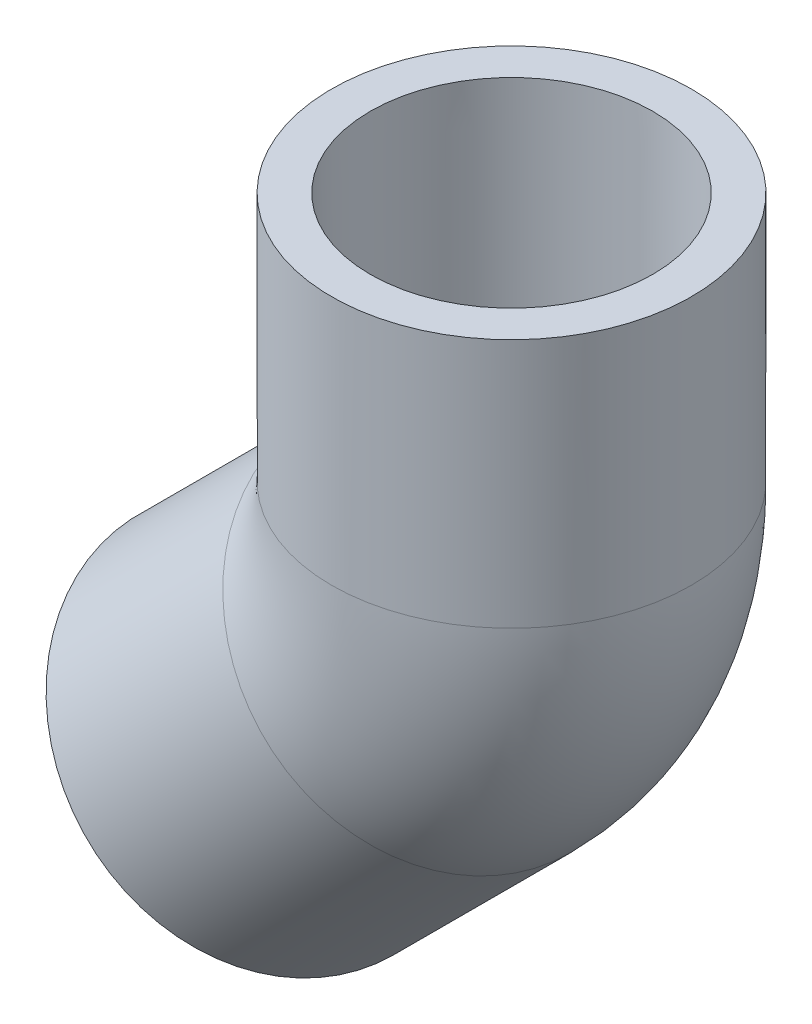
ISO-10303-21;
HEADER;
FILE_DESCRIPTION(('STEP AP214'),'2;1');
FILE_NAME('part.step','',(''),(''),'','','');
FILE_SCHEMA(('AUTOMOTIVE_DESIGN { 1 0 10303 214 1 1 1 1 }'));
ENDSEC;
DATA;
#1=APPLICATION_CONTEXT('core data for automotive mechanical design processes');
#2=APPLICATION_PROTOCOL_DEFINITION('international standard','automotive_design',2000,#1);
#3=PRODUCT_CONTEXT('',#1,'mechanical');
#4=PRODUCT('Part','Part','',(#3));
#5=PRODUCT_RELATED_PRODUCT_CATEGORY('part','',(#4));
#6=PRODUCT_DEFINITION_FORMATION('','',#4);
#7=PRODUCT_DEFINITION_CONTEXT('part definition',#1,'design');
#8=PRODUCT_DEFINITION('design','',#6,#7);
#9=PRODUCT_DEFINITION_SHAPE('','',#8);
#10=(LENGTH_UNIT() NAMED_UNIT(*) SI_UNIT(.MILLI.,.METRE.));
#11=(NAMED_UNIT(*) PLANE_ANGLE_UNIT() SI_UNIT($,.RADIAN.));
#12=(NAMED_UNIT(*) SI_UNIT($,.STERADIAN.) SOLID_ANGLE_UNIT());
#13=UNCERTAINTY_MEASURE_WITH_UNIT(LENGTH_MEASURE(1.E-05),#10,'distance_accuracy_value','');
#14=(GEOMETRIC_REPRESENTATION_CONTEXT(3) GLOBAL_UNCERTAINTY_ASSIGNED_CONTEXT((#13)) GLOBAL_UNIT_ASSIGNED_CONTEXT((#10,
#11,#12)) REPRESENTATION_CONTEXT('',''));
#15=CARTESIAN_POINT('',(0.,0.,0.));
#16=DIRECTION('',(0.,0.,1.));
#17=DIRECTION('',(1.,0.,0.));
#18=AXIS2_PLACEMENT_3D('',#15,#16,#17);
#19=CARTESIAN_POINT('',(-8.9802561210692,-28.3776093425785,0.));
#20=DIRECTION('',(-0.707106781186549,-0.707106781186546,0.));
#21=DIRECTION('',(0.707106781186546,-0.707106781186549,0.));
#22=AXIS2_PLACEMENT_3D('',#19,#20,#21);
#23=PLANE('',#22);
#24=CARTESIAN_POINT('',(-18.6789327318239,-18.6789327318238,0.));
#25=DIRECTION('',(-0.707106781186549,-0.707106781186546,0.));
#26=DIRECTION('',(0.707106781186546,-0.707106781186549,0.));
#27=AXIS2_PLACEMENT_3D('',#24,#25,#26);
#28=CIRCLE('',#27,13.716);
#29=CARTESIAN_POINT('',(-8.9802561210692,-28.3776093425785,0.));
#30=VERTEX_POINT('',#29);
#31=EDGE_CURVE('E48',#30,#30,#28,.T.);
#32=ORIENTED_EDGE('',*,*,#31,.T.);
#33=EDGE_LOOP('',(#32));
#34=FACE_BOUND('',#33,.T.);
#35=CARTESIAN_POINT('',(-18.6789327318239,-18.6789327318238,0.));
#36=DIRECTION('',(-0.707106781186549,-0.707106781186546,0.));
#37=DIRECTION('',(0.707106781186546,-0.707106781186549,0.));
#38=AXIS2_PLACEMENT_3D('',#35,#36,#37);
#39=CIRCLE('',#38,10.7696);
#40=CARTESIAN_POINT('',(-11.0636755411572,-26.2941899224905,0.));
#41=VERTEX_POINT('',#40);
#42=EDGE_CURVE('E35',#41,#41,#39,.T.);
#43=ORIENTED_EDGE('',*,*,#42,.F.);
#44=EDGE_LOOP('',(#43));
#45=FACE_BOUND('',#44,.T.);
#46=ADVANCED_FACE('F29',(#34,#45),#23,.T.);
#47=CARTESIAN_POINT('',(-5.20854855022012,-5.2085485502201,0.));
#48=DIRECTION('',(-0.707106781186549,-0.707106781186546,0.));
#49=DIRECTION('',(0.707106781186546,-0.707106781186549,0.));
#50=AXIS2_PLACEMENT_3D('',#47,#48,#49);
#51=CONICAL_SURFACE('',#50,10.6172,0.00799982933988657);
#52=ORIENTED_EDGE('',*,*,#42,.T.);
#53=EDGE_LOOP('',(#52));
#54=FACE_BOUND('',#53,.T.);
#55=CARTESIAN_POINT('',(-5.20854855022012,-5.2085485502201,0.));
#56=DIRECTION('',(-0.707106781186549,-0.707106781186546,0.));
#57=DIRECTION('',(0.707106781186546,-0.707106781186549,0.));
#58=AXIS2_PLACEMENT_3D('',#55,#56,#57);
#59=CIRCLE('',#58,10.6172);
#60=CARTESIAN_POINT('',(2.29894556699368,-12.7160426674339,0.));
#61=VERTEX_POINT('',#60);
#62=EDGE_CURVE('E39',#61,#61,#59,.T.);
#63=ORIENTED_EDGE('',*,*,#62,.F.);
#64=EDGE_LOOP('',(#63));
#65=FACE_BOUND('',#64,.T.);
#66=ADVANCED_FACE('F80',(#54,#65),#51,.F.);
#67=CARTESIAN_POINT('',(-18.6789327318239,-18.6789327318238,0.));
#68=DIRECTION('',(-0.707106781186549,-0.707106781186546,0.));
#69=DIRECTION('',(0.707106781186546,-0.707106781186549,0.));
#70=AXIS2_PLACEMENT_3D('',#67,#68,#69);
#71=CYLINDRICAL_SURFACE('',#70,13.716);
#72=CARTESIAN_POINT('',(-5.20854855022012,-5.2085485502201,0.));
#73=DIRECTION('',(-0.707106781186549,-0.707106781186546,0.));
#74=DIRECTION('',(0.707106781186546,-0.707106781186549,0.));
#75=AXIS2_PLACEMENT_3D('',#72,#73,#74);
#76=CIRCLE('',#75,13.716);
#77=CARTESIAN_POINT('',(4.49012806053456,-14.9072251609748,0.));
#78=VERTEX_POINT('',#77);
#79=EDGE_CURVE('E43',#78,#78,#76,.T.);
#80=ORIENTED_EDGE('',*,*,#79,.T.);
#81=EDGE_LOOP('',(#80));
#82=FACE_BOUND('',#81,.T.);
#83=ORIENTED_EDGE('',*,*,#31,.F.);
#84=EDGE_LOOP('',(#83));
#85=FACE_BOUND('',#84,.T.);
#86=ADVANCED_FACE('F85',(#82,#85),#71,.T.);
#87=CARTESIAN_POINT('',(-17.7830971004402,7.366,0.));
#88=DIRECTION('',(0.,0.,-1.));
#89=DIRECTION('',(-1.,0.,0.));
#90=AXIS2_PLACEMENT_3D('',#87,#88,#89);
#91=TOROIDAL_SURFACE('',#90,17.7830971004402,7.89939999999997);
#92=CARTESIAN_POINT('',(0.,7.366,0.));
#93=DIRECTION('',(0.,1.,0.));
#94=DIRECTION('',(-1.,0.,0.));
#95=AXIS2_PLACEMENT_3D('',#92,#93,#94);
#96=CIRCLE('',#95,7.89939999999997);
#97=CARTESIAN_POINT('',(7.89939999999997,7.36600000000001,0.));
#98=VERTEX_POINT('',#97);
#99=EDGE_CURVE('E54',#98,#98,#96,.T.);
#100=CARTESIAN_POINT('',(-5.20854855022012,-5.2085485502201,0.));
#101=DIRECTION('',(0.707106781186549,0.707106781186546,0.));
#102=DIRECTION('',(-0.707106781186546,0.707106781186549,0.));
#103=AXIS2_PLACEMENT_3D('',#100,#101,#102);
#104=CIRCLE('',#103,7.89939999999997);
#105=CARTESIAN_POINT('',(0.37717075708487,-10.7942678575251,0.));
#106=VERTEX_POINT('',#105);
#107=EDGE_CURVE('E57',#106,#106,#104,.T.);
#108=CARTESIAN_POINT('',(-17.7830971004402,7.366,0.));
#109=DIRECTION('',(0.,0.,-1.));
#110=DIRECTION('',(-1.,0.,0.));
#111=AXIS2_PLACEMENT_3D('',#108,#109,#110);
#112=CIRCLE('',#111,25.6824971004401);
#113=EDGE_CURVE('',#98,#106,#112,.T.);
#114=ORIENTED_EDGE('',*,*,#99,.T.);
#115=ORIENTED_EDGE('',*,*,#107,.F.);
#116=ORIENTED_EDGE('',*,*,#113,.T.);
#117=ORIENTED_EDGE('',*,*,#113,.F.);
#118=EDGE_LOOP('',(#114,#116,#115,#117));
#119=FACE_BOUND('',#118,.T.);
#120=ADVANCED_FACE('F90',(#119),#91,.F.);
#121=CARTESIAN_POINT('',(-17.7830971004402,7.366,0.));
#122=DIRECTION('',(0.,0.,-1.));
#123=DIRECTION('',(-1.,0.,0.));
#124=AXIS2_PLACEMENT_3D('',#121,#122,#123);
#125=TOROIDAL_SURFACE('',#124,17.7830971004402,13.716);
#126=CARTESIAN_POINT('',(0.,7.366,0.));
#127=DIRECTION('',(0.,1.,0.));
#128=DIRECTION('',(-1.,0.,0.));
#129=AXIS2_PLACEMENT_3D('',#126,#127,#128);
#130=CIRCLE('',#129,13.716);
#131=CARTESIAN_POINT('',(13.716,7.36600000000001,0.));
#132=VERTEX_POINT('',#131);
#133=EDGE_CURVE('E51',#132,#132,#130,.T.);
#134=CARTESIAN_POINT('',(-17.7830971004402,7.366,0.));
#135=DIRECTION('',(0.,0.,-1.));
#136=DIRECTION('',(-1.,0.,0.));
#137=AXIS2_PLACEMENT_3D('',#134,#135,#136);
#138=CIRCLE('',#137,31.4990971004402);
#139=EDGE_CURVE('',#132,#78,#138,.T.);
#140=ORIENTED_EDGE('',*,*,#133,.F.);
#141=ORIENTED_EDGE('',*,*,#79,.F.);
#142=ORIENTED_EDGE('',*,*,#139,.T.);
#143=ORIENTED_EDGE('',*,*,#139,.F.);
#144=EDGE_LOOP('',(#140,#142,#141,#143));
#145=FACE_BOUND('',#144,.T.);
#146=ADVANCED_FACE('F96',(#145),#125,.T.);
#147=CARTESIAN_POINT('',(0.,7.366,0.));
#148=DIRECTION('',(0.,1.,0.));
#149=DIRECTION('',(-1.,0.,0.));
#150=AXIS2_PLACEMENT_3D('',#147,#148,#149);
#151=PLANE('',#150);
#152=CARTESIAN_POINT('',(0.,7.366,0.));
#153=DIRECTION('',(0.,1.,0.));
#154=DIRECTION('',(-1.,0.,0.));
#155=AXIS2_PLACEMENT_3D('',#152,#153,#154);
#156=CIRCLE('',#155,10.6172);
#157=CARTESIAN_POINT('',(-10.6172,7.366,0.));
#158=VERTEX_POINT('',#157);
#159=EDGE_CURVE('E10',#158,#158,#156,.F.);
#160=ORIENTED_EDGE('',*,*,#159,.F.);
#161=EDGE_LOOP('',(#160));
#162=FACE_BOUND('',#161,.T.);
#163=ORIENTED_EDGE('',*,*,#99,.F.);
#164=EDGE_LOOP('',(#163));
#165=FACE_BOUND('',#164,.T.);
#166=ADVANCED_FACE('F99',(#162,#165),#151,.T.);
#167=CARTESIAN_POINT('',(-5.20854855022012,-5.2085485502201,0.));
#168=DIRECTION('',(0.707106781186549,0.707106781186546,0.));
#169=DIRECTION('',(-0.707106781186546,0.707106781186549,0.));
#170=AXIS2_PLACEMENT_3D('',#167,#168,#169);
#171=PLANE('',#170);
#172=ORIENTED_EDGE('',*,*,#62,.T.);
#173=EDGE_LOOP('',(#172));
#174=FACE_BOUND('',#173,.T.);
#175=ORIENTED_EDGE('',*,*,#107,.T.);
#176=EDGE_LOOP('',(#175));
#177=FACE_BOUND('',#176,.T.);
#178=ADVANCED_FACE('F103',(#174,#177),#171,.F.);
#179=CARTESIAN_POINT('',(13.716,26.416,0.));
#180=DIRECTION('',(0.,1.,0.));
#181=DIRECTION('',(0.,0.,1.));
#182=AXIS2_PLACEMENT_3D('',#179,#180,#181);
#183=PLANE('',#182);
#184=CARTESIAN_POINT('',(0.,26.416,0.));
#185=DIRECTION('',(0.,-1.,0.));
#186=DIRECTION('',(0.,0.,-1.));
#187=AXIS2_PLACEMENT_3D('',#184,#185,#186);
#188=CIRCLE('',#187,10.7696);
#189=CARTESIAN_POINT('',(0.,26.416,-10.7696));
#190=VERTEX_POINT('',#189);
#191=EDGE_CURVE('E63',#190,#190,#188,.T.);
#192=ORIENTED_EDGE('',*,*,#191,.T.);
#193=EDGE_LOOP('',(#192));
#194=FACE_BOUND('',#193,.T.);
#195=CARTESIAN_POINT('',(0.,26.416,0.));
#196=DIRECTION('',(0.,-1.,0.));
#197=DIRECTION('',(0.,0.,-1.));
#198=AXIS2_PLACEMENT_3D('',#195,#196,#197);
#199=CIRCLE('',#198,13.716);
#200=CARTESIAN_POINT('',(0.,26.416,-13.716));
#201=VERTEX_POINT('',#200);
#202=EDGE_CURVE('E60',#201,#201,#199,.T.);
#203=ORIENTED_EDGE('',*,*,#202,.F.);
#204=EDGE_LOOP('',(#203));
#205=FACE_BOUND('',#204,.T.);
#206=ADVANCED_FACE('F67',(#194,#205),#183,.T.);
#207=CARTESIAN_POINT('',(0.,0.,0.));
#208=DIRECTION('',(0.,-1.,0.));
#209=DIRECTION('',(0.,0.,-1.));
#210=AXIS2_PLACEMENT_3D('',#207,#208,#209);
#211=CYLINDRICAL_SURFACE('',#210,13.716);
#212=ORIENTED_EDGE('',*,*,#202,.T.);
#213=EDGE_LOOP('',(#212));
#214=FACE_BOUND('',#213,.T.);
#215=ORIENTED_EDGE('',*,*,#133,.T.);
#216=EDGE_LOOP('',(#215));
#217=FACE_BOUND('',#216,.T.);
#218=ADVANCED_FACE('F72',(#214,#217),#211,.T.);
#219=CARTESIAN_POINT('',(0.,26.416,0.));
#220=DIRECTION('',(0.,1.,0.));
#221=DIRECTION('',(0.,0.,1.));
#222=AXIS2_PLACEMENT_3D('',#219,#220,#221);
#223=CONICAL_SURFACE('',#222,10.7696,0.00799982933988666);
#224=ORIENTED_EDGE('',*,*,#159,.T.);
#225=EDGE_LOOP('',(#224));
#226=FACE_BOUND('',#225,.T.);
#227=ORIENTED_EDGE('',*,*,#191,.F.);
#228=EDGE_LOOP('',(#227));
#229=FACE_BOUND('',#228,.T.);
#230=ADVANCED_FACE('F70',(#226,#229),#223,.F.);
#231=CLOSED_SHELL('',(#46,#66,#86,#120,#146,#166,#178,#206,#218,#230));
#232=MANIFOLD_SOLID_BREP('B2',#231);
#233=ADVANCED_BREP_SHAPE_REPRESENTATION('',(#18,#232),#14);
#234=SHAPE_DEFINITION_REPRESENTATION(#9,#233);
ENDSEC;
END-ISO-10303-21;
